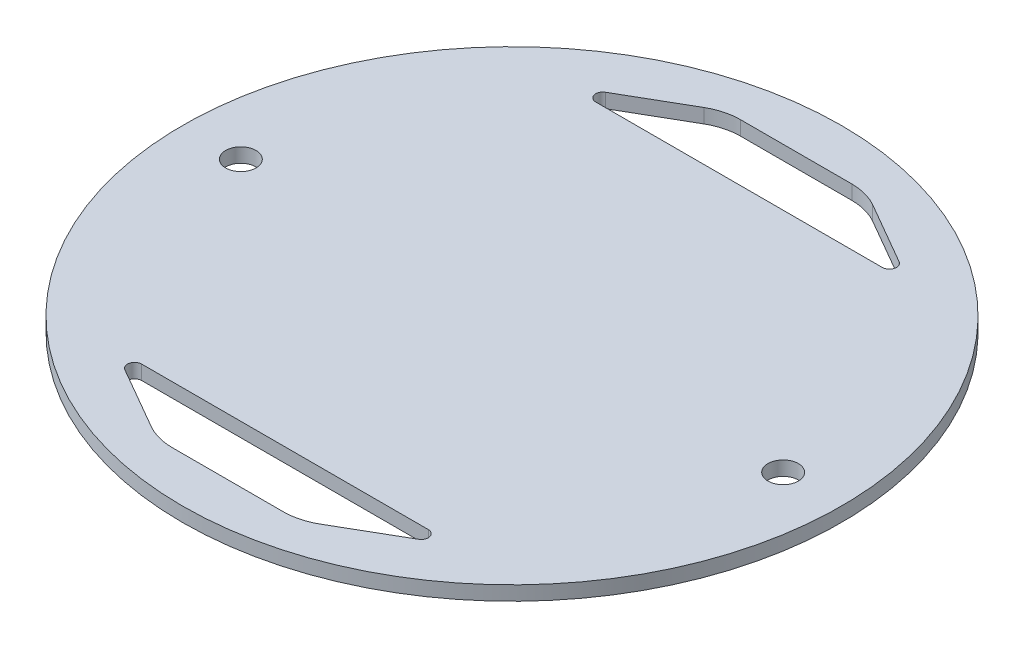
ISO-10303-21;
HEADER;
FILE_DESCRIPTION(('STEP AP214'),'2;1');
FILE_NAME('part.step','',(''),(''),'','','');
FILE_SCHEMA(('AUTOMOTIVE_DESIGN { 1 0 10303 214 1 1 1 1 }'));
ENDSEC;
DATA;
#1=APPLICATION_CONTEXT('core data for automotive mechanical design processes');
#2=APPLICATION_PROTOCOL_DEFINITION('international standard','automotive_design',2000,#1);
#3=PRODUCT_CONTEXT('',#1,'mechanical');
#4=PRODUCT('Part','Part','',(#3));
#5=PRODUCT_RELATED_PRODUCT_CATEGORY('part','',(#4));
#6=PRODUCT_DEFINITION_FORMATION('','',#4);
#7=PRODUCT_DEFINITION_CONTEXT('part definition',#1,'design');
#8=PRODUCT_DEFINITION('design','',#6,#7);
#9=PRODUCT_DEFINITION_SHAPE('','',#8);
#10=(LENGTH_UNIT() NAMED_UNIT(*) SI_UNIT(.MILLI.,.METRE.));
#11=(NAMED_UNIT(*) PLANE_ANGLE_UNIT() SI_UNIT($,.RADIAN.));
#12=(NAMED_UNIT(*) SI_UNIT($,.STERADIAN.) SOLID_ANGLE_UNIT());
#13=UNCERTAINTY_MEASURE_WITH_UNIT(LENGTH_MEASURE(1.E-05),#10,'distance_accuracy_value','');
#14=(GEOMETRIC_REPRESENTATION_CONTEXT(3) GLOBAL_UNCERTAINTY_ASSIGNED_CONTEXT((#13)) GLOBAL_UNIT_ASSIGNED_CONTEXT((#10,
#11,#12)) REPRESENTATION_CONTEXT('',''));
#15=CARTESIAN_POINT('',(0.,0.,0.));
#16=DIRECTION('',(0.,0.,1.));
#17=DIRECTION('',(1.,0.,0.));
#18=AXIS2_PLACEMENT_3D('',#15,#16,#17);
#19=CARTESIAN_POINT('',(0.,3.175,0.));
#20=DIRECTION('',(0.,1.,0.));
#21=DIRECTION('',(0.,0.,1.));
#22=AXIS2_PLACEMENT_3D('',#19,#20,#21);
#23=PLANE('',#22);
#24=DIRECTION('',(-0.866025403784442,0.,0.499999999999995));
#25=VECTOR('',#24,1.);
#26=CARTESIAN_POINT('',(-31.3171414455567,3.175,-54.242880131526));
#27=LINE('',#26,#25);
#28=CARTESIAN_POINT('',(-18.7499999999997,3.175,-61.4985226280624));
#29=VERTEX_POINT('',#28);
#30=CARTESIAN_POINT('',(-32.6691193429844,3.175,-53.4623153285078));
#31=VERTEX_POINT('',#30);
#32=EDGE_CURVE('E282',#29,#31,#27,.T.);
#33=ORIENTED_EDGE('',*,*,#32,.F.);
#34=CARTESIAN_POINT('',(-12.3999999999998,3.175,-50.5));
#35=DIRECTION('',(0.,1.,0.));
#36=DIRECTION('',(0.,0.,1.));
#37=AXIS2_PLACEMENT_3D('',#34,#35,#36);
#38=CIRCLE('',#37,12.7);
#39=CARTESIAN_POINT('',(-12.3999999999998,3.175,-63.2));
#40=VERTEX_POINT('',#39);
#41=EDGE_CURVE('E182',#29,#40,#38,.F.);
#42=ORIENTED_EDGE('',*,*,#41,.T.);
#43=DIRECTION('',(1.,0.,0.));
#44=VECTOR('',#43,1.);
#45=CARTESIAN_POINT('',(0.,3.175,-63.2));
#46=LINE('',#45,#44);
#47=CARTESIAN_POINT('',(12.3999999999998,3.175,-63.2));
#48=VERTEX_POINT('',#47);
#49=EDGE_CURVE('E160',#40,#48,#46,.T.);
#50=ORIENTED_EDGE('',*,*,#49,.T.);
#51=CARTESIAN_POINT('',(12.3999999999998,3.175,-50.5));
#52=DIRECTION('',(0.,1.,0.));
#53=DIRECTION('',(0.,0.,1.));
#54=AXIS2_PLACEMENT_3D('',#51,#52,#53);
#55=CIRCLE('',#54,12.7);
#56=CARTESIAN_POINT('',(18.7499999999997,3.175,-61.4985226280624));
#57=VERTEX_POINT('',#56);
#58=EDGE_CURVE('E306',#48,#57,#55,.F.);
#59=ORIENTED_EDGE('',*,*,#58,.T.);
#60=DIRECTION('',(0.866025403784442,0.,0.499999999999995));
#61=VECTOR('',#60,1.);
#62=CARTESIAN_POINT('',(31.3171414455567,3.175,-54.242880131526));
#63=LINE('',#62,#61);
#64=CARTESIAN_POINT('',(32.6691193429844,3.175,-53.4623153285078));
#65=VERTEX_POINT('',#64);
#66=EDGE_CURVE('E278',#57,#65,#63,.T.);
#67=ORIENTED_EDGE('',*,*,#66,.T.);
#68=CARTESIAN_POINT('',(31.8753693429844,3.175,-52.0875));
#69=DIRECTION('',(0.,1.,0.));
#70=DIRECTION('',(0.,0.,1.));
#71=AXIS2_PLACEMENT_3D('',#68,#69,#70);
#72=CIRCLE('',#71,1.5875);
#73=CARTESIAN_POINT('',(31.8753693429844,3.175,-50.5));
#74=VERTEX_POINT('',#73);
#75=EDGE_CURVE('E196',#65,#74,#72,.F.);
#76=ORIENTED_EDGE('',*,*,#75,.T.);
#77=DIRECTION('',(1.,0.,0.));
#78=VECTOR('',#77,1.);
#79=CARTESIAN_POINT('',(0.,3.175,-50.5));
#80=LINE('',#79,#78);
#81=CARTESIAN_POINT('',(-31.8753693429844,3.175,-50.5));
#82=VERTEX_POINT('',#81);
#83=EDGE_CURVE('E174',#82,#74,#80,.T.);
#84=ORIENTED_EDGE('',*,*,#83,.F.);
#85=CARTESIAN_POINT('',(-31.8753693429844,3.175,-52.0875));
#86=DIRECTION('',(0.,1.,0.));
#87=DIRECTION('',(0.,0.,1.));
#88=AXIS2_PLACEMENT_3D('',#85,#86,#87);
#89=CIRCLE('',#88,1.5875);
#90=EDGE_CURVE('E200',#82,#31,#89,.F.);
#91=ORIENTED_EDGE('',*,*,#90,.T.);
#92=EDGE_LOOP('',(#33,#42,#50,#59,#67,#76,#84,#91));
#93=FACE_BOUND('',#92,.T.);
#94=CARTESIAN_POINT('',(-60.325,3.175,0.));
#95=DIRECTION('',(0.,1.,0.));
#96=DIRECTION('',(0.,0.,1.));
#97=AXIS2_PLACEMENT_3D('',#94,#95,#96);
#98=CIRCLE('',#97,3.37819999999999);
#99=CARTESIAN_POINT('',(-60.325,3.175,3.37819999999999));
#100=VERTEX_POINT('',#99);
#101=EDGE_CURVE('E285',#100,#100,#98,.T.);
#102=ORIENTED_EDGE('',*,*,#101,.F.);
#103=EDGE_LOOP('',(#102));
#104=FACE_BOUND('',#103,.T.);
#105=CARTESIAN_POINT('',(60.325,3.175,0.));
#106=DIRECTION('',(0.,1.,0.));
#107=DIRECTION('',(0.,0.,1.));
#108=AXIS2_PLACEMENT_3D('',#105,#106,#107);
#109=CIRCLE('',#108,3.37819999999999);
#110=CARTESIAN_POINT('',(60.325,3.175,3.37819999999999));
#111=VERTEX_POINT('',#110);
#112=EDGE_CURVE('E291',#111,#111,#109,.T.);
#113=ORIENTED_EDGE('',*,*,#112,.F.);
#114=EDGE_LOOP('',(#113));
#115=FACE_BOUND('',#114,.T.);
#116=CARTESIAN_POINT('',(0.,3.175,0.));
#117=DIRECTION('',(0.,1.,0.));
#118=DIRECTION('',(0.,0.,1.));
#119=AXIS2_PLACEMENT_3D('',#116,#117,#118);
#120=CIRCLE('',#119,73.3171);
#121=CARTESIAN_POINT('',(0.,3.175,73.3171));
#122=VERTEX_POINT('',#121);
#123=EDGE_CURVE('E164',#122,#122,#120,.T.);
#124=ORIENTED_EDGE('',*,*,#123,.T.);
#125=EDGE_LOOP('',(#124));
#126=FACE_BOUND('',#125,.T.);
#127=DIRECTION('',(1.,0.,0.));
#128=VECTOR('',#127,1.);
#129=CARTESIAN_POINT('',(0.,3.175,63.2));
#130=LINE('',#129,#128);
#131=CARTESIAN_POINT('',(-12.3999999999998,3.175,63.2));
#132=VERTEX_POINT('',#131);
#133=CARTESIAN_POINT('',(12.3999999999998,3.175,63.2));
#134=VERTEX_POINT('',#133);
#135=EDGE_CURVE('E263',#132,#134,#130,.T.);
#136=ORIENTED_EDGE('',*,*,#135,.F.);
#137=CARTESIAN_POINT('',(-12.3999999999998,3.175,50.5));
#138=DIRECTION('',(0.,1.,0.));
#139=DIRECTION('',(0.,0.,1.));
#140=AXIS2_PLACEMENT_3D('',#137,#138,#139);
#141=CIRCLE('',#140,12.7);
#142=CARTESIAN_POINT('',(-18.7499999999997,3.175,61.4985226280624));
#143=VERTEX_POINT('',#142);
#144=EDGE_CURVE('E218',#132,#143,#141,.F.);
#145=ORIENTED_EDGE('',*,*,#144,.T.);
#146=DIRECTION('',(-0.866025403784442,0.,-0.499999999999995));
#147=VECTOR('',#146,1.);
#148=CARTESIAN_POINT('',(-31.3171414455567,3.175,54.242880131526));
#149=LINE('',#148,#147);
#150=CARTESIAN_POINT('',(-32.6691193429844,3.175,53.4623153285078));
#151=VERTEX_POINT('',#150);
#152=EDGE_CURVE('E241',#143,#151,#149,.T.);
#153=ORIENTED_EDGE('',*,*,#152,.T.);
#154=CARTESIAN_POINT('',(-31.8753693429844,3.175,52.0875));
#155=DIRECTION('',(0.,1.,0.));
#156=DIRECTION('',(0.,0.,1.));
#157=AXIS2_PLACEMENT_3D('',#154,#155,#156);
#158=CIRCLE('',#157,1.5875);
#159=CARTESIAN_POINT('',(-31.8753693429844,3.175,50.5));
#160=VERTEX_POINT('',#159);
#161=EDGE_CURVE('E47',#151,#160,#158,.F.);
#162=ORIENTED_EDGE('',*,*,#161,.T.);
#163=DIRECTION('',(1.,0.,0.));
#164=VECTOR('',#163,1.);
#165=CARTESIAN_POINT('',(0.,3.175,50.5));
#166=LINE('',#165,#164);
#167=CARTESIAN_POINT('',(31.8753693429844,3.175,50.5));
#168=VERTEX_POINT('',#167);
#169=EDGE_CURVE('E239',#160,#168,#166,.T.);
#170=ORIENTED_EDGE('',*,*,#169,.T.);
#171=CARTESIAN_POINT('',(31.8753693429844,3.175,52.0875));
#172=DIRECTION('',(0.,1.,0.));
#173=DIRECTION('',(0.,0.,1.));
#174=AXIS2_PLACEMENT_3D('',#171,#172,#173);
#175=CIRCLE('',#174,1.5875);
#176=CARTESIAN_POINT('',(32.6691193429844,3.175,53.4623153285078));
#177=VERTEX_POINT('',#176);
#178=EDGE_CURVE('E231',#168,#177,#175,.F.);
#179=ORIENTED_EDGE('',*,*,#178,.T.);
#180=DIRECTION('',(0.866025403784442,0.,-0.499999999999995));
#181=VECTOR('',#180,1.);
#182=CARTESIAN_POINT('',(31.3171414455567,3.175,54.242880131526));
#183=LINE('',#182,#181);
#184=CARTESIAN_POINT('',(18.7499999999997,3.175,61.4985226280624));
#185=VERTEX_POINT('',#184);
#186=EDGE_CURVE('E246',#185,#177,#183,.T.);
#187=ORIENTED_EDGE('',*,*,#186,.F.);
#188=CARTESIAN_POINT('',(12.3999999999998,3.175,50.5));
#189=DIRECTION('',(0.,1.,0.));
#190=DIRECTION('',(0.,0.,1.));
#191=AXIS2_PLACEMENT_3D('',#188,#189,#190);
#192=CIRCLE('',#191,12.7);
#193=EDGE_CURVE('E214',#185,#134,#192,.F.);
#194=ORIENTED_EDGE('',*,*,#193,.T.);
#195=EDGE_LOOP('',(#136,#145,#153,#162,#170,#179,#187,#194));
#196=FACE_BOUND('',#195,.T.);
#197=ADVANCED_FACE('F39',(#93,#104,#115,#126,#196),#23,.T.);
#198=CARTESIAN_POINT('',(0.,0.,0.));
#199=DIRECTION('',(0.,1.,0.));
#200=DIRECTION('',(0.,0.,1.));
#201=AXIS2_PLACEMENT_3D('',#198,#199,#200);
#202=PLANE('',#201);
#203=CARTESIAN_POINT('',(0.,0.,0.));
#204=DIRECTION('',(0.,1.,0.));
#205=DIRECTION('',(0.,0.,1.));
#206=AXIS2_PLACEMENT_3D('',#203,#204,#205);
#207=CIRCLE('',#206,73.3171);
#208=CARTESIAN_POINT('',(0.,0.,73.3171));
#209=VERTEX_POINT('',#208);
#210=EDGE_CURVE('E297',#209,#209,#207,.T.);
#211=ORIENTED_EDGE('',*,*,#210,.F.);
#212=EDGE_LOOP('',(#211));
#213=FACE_BOUND('',#212,.T.);
#214=CARTESIAN_POINT('',(60.325,0.,0.));
#215=DIRECTION('',(0.,1.,0.));
#216=DIRECTION('',(0.,0.,1.));
#217=AXIS2_PLACEMENT_3D('',#214,#215,#216);
#218=CIRCLE('',#217,3.3782);
#219=CARTESIAN_POINT('',(60.325,0.,3.3782));
#220=VERTEX_POINT('',#219);
#221=EDGE_CURVE('E294',#220,#220,#218,.T.);
#222=ORIENTED_EDGE('',*,*,#221,.T.);
#223=EDGE_LOOP('',(#222));
#224=FACE_BOUND('',#223,.T.);
#225=CARTESIAN_POINT('',(-60.325,0.,0.));
#226=DIRECTION('',(0.,1.,0.));
#227=DIRECTION('',(0.,0.,1.));
#228=AXIS2_PLACEMENT_3D('',#225,#226,#227);
#229=CIRCLE('',#228,3.3782);
#230=CARTESIAN_POINT('',(-60.325,0.,3.3782));
#231=VERTEX_POINT('',#230);
#232=EDGE_CURVE('E288',#231,#231,#229,.T.);
#233=ORIENTED_EDGE('',*,*,#232,.T.);
#234=EDGE_LOOP('',(#233));
#235=FACE_BOUND('',#234,.T.);
#236=DIRECTION('',(1.,0.,0.));
#237=VECTOR('',#236,1.);
#238=CARTESIAN_POINT('',(0.,0.,-63.2));
#239=LINE('',#238,#237);
#240=CARTESIAN_POINT('',(-12.3999999999998,0.,-63.2));
#241=VERTEX_POINT('',#240);
#242=CARTESIAN_POINT('',(12.3999999999998,0.,-63.2));
#243=VERTEX_POINT('',#242);
#244=EDGE_CURVE('E157',#241,#243,#239,.T.);
#245=ORIENTED_EDGE('',*,*,#244,.F.);
#246=CARTESIAN_POINT('',(-12.3999999999998,0.,-50.5));
#247=DIRECTION('',(0.,1.,0.));
#248=DIRECTION('',(0.,0.,1.));
#249=AXIS2_PLACEMENT_3D('',#246,#247,#248);
#250=CIRCLE('',#249,12.7);
#251=CARTESIAN_POINT('',(-18.7499999999997,0.,-61.4985226280624));
#252=VERTEX_POINT('',#251);
#253=EDGE_CURVE('E169',#241,#252,#250,.T.);
#254=ORIENTED_EDGE('',*,*,#253,.T.);
#255=DIRECTION('',(-0.866025403784442,0.,0.499999999999995));
#256=VECTOR('',#255,1.);
#257=CARTESIAN_POINT('',(-31.3171414455567,0.,-54.242880131526));
#258=LINE('',#257,#256);
#259=CARTESIAN_POINT('',(-32.6691193429844,0.,-53.4623153285078));
#260=VERTEX_POINT('',#259);
#261=EDGE_CURVE('E269',#252,#260,#258,.T.);
#262=ORIENTED_EDGE('',*,*,#261,.T.);
#263=CARTESIAN_POINT('',(-31.8753693429844,0.,-52.0875));
#264=DIRECTION('',(0.,1.,0.));
#265=DIRECTION('',(0.,0.,1.));
#266=AXIS2_PLACEMENT_3D('',#263,#264,#265);
#267=CIRCLE('',#266,1.5875);
#268=CARTESIAN_POINT('',(-31.8753693429844,0.,-50.5));
#269=VERTEX_POINT('',#268);
#270=EDGE_CURVE('E202',#260,#269,#267,.T.);
#271=ORIENTED_EDGE('',*,*,#270,.T.);
#272=DIRECTION('',(1.,0.,0.));
#273=VECTOR('',#272,1.);
#274=CARTESIAN_POINT('',(0.,0.,-50.5));
#275=LINE('',#274,#273);
#276=CARTESIAN_POINT('',(31.8753693429844,0.,-50.5));
#277=VERTEX_POINT('',#276);
#278=EDGE_CURVE('E271',#269,#277,#275,.T.);
#279=ORIENTED_EDGE('',*,*,#278,.T.);
#280=CARTESIAN_POINT('',(31.8753693429844,0.,-52.0875));
#281=DIRECTION('',(0.,1.,0.));
#282=DIRECTION('',(0.,0.,1.));
#283=AXIS2_PLACEMENT_3D('',#280,#281,#282);
#284=CIRCLE('',#283,1.5875);
#285=CARTESIAN_POINT('',(32.6691193429844,0.,-53.4623153285078));
#286=VERTEX_POINT('',#285);
#287=EDGE_CURVE('E198',#277,#286,#284,.T.);
#288=ORIENTED_EDGE('',*,*,#287,.T.);
#289=DIRECTION('',(0.866025403784442,0.,0.499999999999995));
#290=VECTOR('',#289,1.);
#291=CARTESIAN_POINT('',(31.3171414455567,0.,-54.242880131526));
#292=LINE('',#291,#290);
#293=CARTESIAN_POINT('',(18.7499999999997,0.,-61.4985226280624));
#294=VERTEX_POINT('',#293);
#295=EDGE_CURVE('E175',#294,#286,#292,.T.);
#296=ORIENTED_EDGE('',*,*,#295,.F.);
#297=CARTESIAN_POINT('',(12.3999999999998,0.,-50.5));
#298=DIRECTION('',(0.,1.,0.));
#299=DIRECTION('',(0.,0.,1.));
#300=AXIS2_PLACEMENT_3D('',#297,#298,#299);
#301=CIRCLE('',#300,12.7);
#302=EDGE_CURVE('E173',#294,#243,#301,.T.);
#303=ORIENTED_EDGE('',*,*,#302,.T.);
#304=EDGE_LOOP('',(#245,#254,#262,#271,#279,#288,#296,#303));
#305=FACE_BOUND('',#304,.T.);
#306=DIRECTION('',(-0.866025403784442,0.,-0.499999999999995));
#307=VECTOR('',#306,1.);
#308=CARTESIAN_POINT('',(-31.3171414455567,0.,54.242880131526));
#309=LINE('',#308,#307);
#310=CARTESIAN_POINT('',(-18.7499999999997,0.,61.4985226280624));
#311=VERTEX_POINT('',#310);
#312=CARTESIAN_POINT('',(-32.6691193429844,0.,53.4623153285078));
#313=VERTEX_POINT('',#312);
#314=EDGE_CURVE('E251',#311,#313,#309,.T.);
#315=ORIENTED_EDGE('',*,*,#314,.F.);
#316=CARTESIAN_POINT('',(-12.3999999999998,0.,50.5));
#317=DIRECTION('',(0.,1.,0.));
#318=DIRECTION('',(0.,0.,1.));
#319=AXIS2_PLACEMENT_3D('',#316,#317,#318);
#320=CIRCLE('',#319,12.7);
#321=CARTESIAN_POINT('',(-12.3999999999998,0.,63.2));
#322=VERTEX_POINT('',#321);
#323=EDGE_CURVE('E220',#311,#322,#320,.T.);
#324=ORIENTED_EDGE('',*,*,#323,.T.);
#325=DIRECTION('',(1.,0.,0.));
#326=VECTOR('',#325,1.);
#327=CARTESIAN_POINT('',(0.,0.,63.2));
#328=LINE('',#327,#326);
#329=CARTESIAN_POINT('',(12.3999999999998,0.,63.2));
#330=VERTEX_POINT('',#329);
#331=EDGE_CURVE('E253',#322,#330,#328,.T.);
#332=ORIENTED_EDGE('',*,*,#331,.T.);
#333=CARTESIAN_POINT('',(12.3999999999998,0.,50.5));
#334=DIRECTION('',(0.,1.,0.));
#335=DIRECTION('',(0.,0.,1.));
#336=AXIS2_PLACEMENT_3D('',#333,#334,#335);
#337=CIRCLE('',#336,12.7);
#338=CARTESIAN_POINT('',(18.7499999999997,0.,61.4985226280624));
#339=VERTEX_POINT('',#338);
#340=EDGE_CURVE('E216',#330,#339,#337,.T.);
#341=ORIENTED_EDGE('',*,*,#340,.T.);
#342=DIRECTION('',(0.866025403784442,0.,-0.499999999999995));
#343=VECTOR('',#342,1.);
#344=CARTESIAN_POINT('',(31.3171414455567,0.,54.242880131526));
#345=LINE('',#344,#343);
#346=CARTESIAN_POINT('',(32.6691193429844,0.,53.4623153285078));
#347=VERTEX_POINT('',#346);
#348=EDGE_CURVE('E256',#339,#347,#345,.T.);
#349=ORIENTED_EDGE('',*,*,#348,.T.);
#350=CARTESIAN_POINT('',(31.8753693429844,0.,52.0875));
#351=DIRECTION('',(0.,1.,0.));
#352=DIRECTION('',(0.,0.,1.));
#353=AXIS2_PLACEMENT_3D('',#350,#351,#352);
#354=CIRCLE('',#353,1.5875);
#355=CARTESIAN_POINT('',(31.8753693429844,0.,50.5));
#356=VERTEX_POINT('',#355);
#357=EDGE_CURVE('E233',#347,#356,#354,.T.);
#358=ORIENTED_EDGE('',*,*,#357,.T.);
#359=DIRECTION('',(1.,0.,0.));
#360=VECTOR('',#359,1.);
#361=CARTESIAN_POINT('',(0.,0.,50.5));
#362=LINE('',#361,#360);
#363=CARTESIAN_POINT('',(-31.8753693429844,0.,50.5));
#364=VERTEX_POINT('',#363);
#365=EDGE_CURVE('E261',#364,#356,#362,.T.);
#366=ORIENTED_EDGE('',*,*,#365,.F.);
#367=CARTESIAN_POINT('',(-31.8753693429844,0.,52.0875));
#368=DIRECTION('',(0.,1.,0.));
#369=DIRECTION('',(0.,0.,1.));
#370=AXIS2_PLACEMENT_3D('',#367,#368,#369);
#371=CIRCLE('',#370,1.5875);
#372=EDGE_CURVE('E11',#364,#313,#371,.T.);
#373=ORIENTED_EDGE('',*,*,#372,.T.);
#374=EDGE_LOOP('',(#315,#324,#332,#341,#349,#358,#366,#373));
#375=FACE_BOUND('',#374,.T.);
#376=ADVANCED_FACE('F167',(#213,#224,#235,#305,#375),#202,.F.);
#377=CARTESIAN_POINT('',(0.,3.175,0.));
#378=DIRECTION('',(0.,-1.,0.));
#379=DIRECTION('',(0.,0.,-1.));
#380=AXIS2_PLACEMENT_3D('',#377,#378,#379);
#381=CYLINDRICAL_SURFACE('',#380,73.3171);
#382=ORIENTED_EDGE('',*,*,#123,.F.);
#383=EDGE_LOOP('',(#382));
#384=FACE_BOUND('',#383,.T.);
#385=ORIENTED_EDGE('',*,*,#210,.T.);
#386=EDGE_LOOP('',(#385));
#387=FACE_BOUND('',#386,.T.);
#388=ADVANCED_FACE('F336',(#384,#387),#381,.T.);
#389=CARTESIAN_POINT('',(60.325,3.175,0.));
#390=DIRECTION('',(0.,1.,0.));
#391=DIRECTION('',(0.,0.,1.));
#392=AXIS2_PLACEMENT_3D('',#389,#390,#391);
#393=CYLINDRICAL_SURFACE('',#392,3.3782);
#394=ORIENTED_EDGE('',*,*,#221,.F.);
#395=EDGE_LOOP('',(#394));
#396=FACE_BOUND('',#395,.T.);
#397=ORIENTED_EDGE('',*,*,#112,.T.);
#398=EDGE_LOOP('',(#397));
#399=FACE_BOUND('',#398,.T.);
#400=ADVANCED_FACE('F340',(#396,#399),#393,.F.);
#401=CARTESIAN_POINT('',(-60.325,3.175,0.));
#402=DIRECTION('',(0.,1.,0.));
#403=DIRECTION('',(0.,0.,1.));
#404=AXIS2_PLACEMENT_3D('',#401,#402,#403);
#405=CYLINDRICAL_SURFACE('',#404,3.37819999999999);
#406=ORIENTED_EDGE('',*,*,#232,.F.);
#407=EDGE_LOOP('',(#406));
#408=FACE_BOUND('',#407,.T.);
#409=ORIENTED_EDGE('',*,*,#101,.T.);
#410=EDGE_LOOP('',(#409));
#411=FACE_BOUND('',#410,.T.);
#412=ADVANCED_FACE('F347',(#408,#411),#405,.F.);
#413=CARTESIAN_POINT('',(-31.3171414455567,0.,-54.242880131526));
#414=DIRECTION('',(-0.499999999999995,0.,-0.866025403784441));
#415=DIRECTION('',(-0.866025403784442,0.,0.499999999999995));
#416=AXIS2_PLACEMENT_3D('',#413,#414,#415);
#417=PLANE('',#416);
#418=ORIENTED_EDGE('',*,*,#32,.T.);
#419=DIRECTION('',(0.,1.,0.));
#420=VECTOR('',#419,1.);
#421=CARTESIAN_POINT('',(-32.6691193429844,0.,-53.4623153285078));
#422=LINE('',#421,#420);
#423=EDGE_CURVE('E194',#31,#260,#422,.F.);
#424=ORIENTED_EDGE('',*,*,#423,.T.);
#425=ORIENTED_EDGE('',*,*,#261,.F.);
#426=DIRECTION('',(0.,1.,0.));
#427=VECTOR('',#426,1.);
#428=CARTESIAN_POINT('',(-18.7499999999997,0.,-61.4985226280624));
#429=LINE('',#428,#427);
#430=EDGE_CURVE('E180',#252,#29,#429,.T.);
#431=ORIENTED_EDGE('',*,*,#430,.T.);
#432=EDGE_LOOP('',(#418,#424,#425,#431));
#433=FACE_BOUND('',#432,.T.);
#434=ADVANCED_FACE('F359',(#433),#417,.F.);
#435=CARTESIAN_POINT('',(0.,0.,-63.2));
#436=DIRECTION('',(0.,0.,1.));
#437=DIRECTION('',(1.,0.,0.));
#438=AXIS2_PLACEMENT_3D('',#435,#436,#437);
#439=PLANE('',#438);
#440=ORIENTED_EDGE('',*,*,#244,.T.);
#441=DIRECTION('',(0.,1.,0.));
#442=VECTOR('',#441,1.);
#443=CARTESIAN_POINT('',(12.3999999999998,3.175,-63.2));
#444=LINE('',#443,#442);
#445=EDGE_CURVE('E163',#243,#48,#444,.T.);
#446=ORIENTED_EDGE('',*,*,#445,.T.);
#447=ORIENTED_EDGE('',*,*,#49,.F.);
#448=DIRECTION('',(0.,1.,0.));
#449=VECTOR('',#448,1.);
#450=CARTESIAN_POINT('',(-12.3999999999998,0.,-63.2));
#451=LINE('',#450,#449);
#452=EDGE_CURVE('E153',#40,#241,#451,.F.);
#453=ORIENTED_EDGE('',*,*,#452,.T.);
#454=EDGE_LOOP('',(#440,#446,#447,#453));
#455=FACE_BOUND('',#454,.T.);
#456=ADVANCED_FACE('F155',(#455),#439,.T.);
#457=CARTESIAN_POINT('',(31.3171414455567,0.,-54.242880131526));
#458=DIRECTION('',(-0.499999999999995,0.,0.866025403784441));
#459=DIRECTION('',(0.866025403784442,0.,0.499999999999995));
#460=AXIS2_PLACEMENT_3D('',#457,#458,#459);
#461=PLANE('',#460);
#462=ORIENTED_EDGE('',*,*,#295,.T.);
#463=DIRECTION('',(0.,1.,0.));
#464=VECTOR('',#463,1.);
#465=CARTESIAN_POINT('',(32.6691193429844,0.,-53.4623153285078));
#466=LINE('',#465,#464);
#467=EDGE_CURVE('E181',#286,#65,#466,.T.);
#468=ORIENTED_EDGE('',*,*,#467,.T.);
#469=ORIENTED_EDGE('',*,*,#66,.F.);
#470=DIRECTION('',(0.,1.,0.));
#471=VECTOR('',#470,1.);
#472=CARTESIAN_POINT('',(18.7499999999997,0.,-61.4985226280624));
#473=LINE('',#472,#471);
#474=EDGE_CURVE('E303',#57,#294,#473,.F.);
#475=ORIENTED_EDGE('',*,*,#474,.T.);
#476=EDGE_LOOP('',(#462,#468,#469,#475));
#477=FACE_BOUND('',#476,.T.);
#478=ADVANCED_FACE('F314',(#477),#461,.T.);
#479=CARTESIAN_POINT('',(0.,0.,-50.5));
#480=DIRECTION('',(0.,0.,1.));
#481=DIRECTION('',(1.,0.,0.));
#482=AXIS2_PLACEMENT_3D('',#479,#480,#481);
#483=PLANE('',#482);
#484=ORIENTED_EDGE('',*,*,#83,.T.);
#485=DIRECTION('',(0.,1.,0.));
#486=VECTOR('',#485,1.);
#487=CARTESIAN_POINT('',(31.8753693429844,0.,-50.5));
#488=LINE('',#487,#486);
#489=EDGE_CURVE('E192',#74,#277,#488,.F.);
#490=ORIENTED_EDGE('',*,*,#489,.T.);
#491=ORIENTED_EDGE('',*,*,#278,.F.);
#492=DIRECTION('',(0.,1.,0.));
#493=VECTOR('',#492,1.);
#494=CARTESIAN_POINT('',(-31.8753693429844,3.175,-50.5));
#495=LINE('',#494,#493);
#496=EDGE_CURVE('E185',#269,#82,#495,.T.);
#497=ORIENTED_EDGE('',*,*,#496,.T.);
#498=EDGE_LOOP('',(#484,#490,#491,#497));
#499=FACE_BOUND('',#498,.T.);
#500=ADVANCED_FACE('F318',(#499),#483,.F.);
#501=CARTESIAN_POINT('',(12.3999999999998,0.,-50.5));
#502=DIRECTION('',(0.,-1.,0.));
#503=DIRECTION('',(0.,0.,-1.));
#504=AXIS2_PLACEMENT_3D('',#501,#502,#503);
#505=CYLINDRICAL_SURFACE('',#504,12.7);
#506=ORIENTED_EDGE('',*,*,#302,.F.);
#507=ORIENTED_EDGE('',*,*,#474,.F.);
#508=ORIENTED_EDGE('',*,*,#58,.F.);
#509=ORIENTED_EDGE('',*,*,#445,.F.);
#510=EDGE_LOOP('',(#506,#507,#508,#509));
#511=FACE_BOUND('',#510,.T.);
#512=ADVANCED_FACE('F316',(#511),#505,.F.);
#513=CARTESIAN_POINT('',(-12.3999999999998,0.,-50.5));
#514=DIRECTION('',(0.,1.,0.));
#515=DIRECTION('',(0.,0.,1.));
#516=AXIS2_PLACEMENT_3D('',#513,#514,#515);
#517=CYLINDRICAL_SURFACE('',#516,12.7);
#518=ORIENTED_EDGE('',*,*,#253,.F.);
#519=ORIENTED_EDGE('',*,*,#452,.F.);
#520=ORIENTED_EDGE('',*,*,#41,.F.);
#521=ORIENTED_EDGE('',*,*,#430,.F.);
#522=EDGE_LOOP('',(#518,#519,#520,#521));
#523=FACE_BOUND('',#522,.T.);
#524=ADVANCED_FACE('F178',(#523),#517,.F.);
#525=CARTESIAN_POINT('',(31.8753693429844,0.,-52.0875));
#526=DIRECTION('',(0.,1.,0.));
#527=DIRECTION('',(0.,0.,1.));
#528=AXIS2_PLACEMENT_3D('',#525,#526,#527);
#529=CYLINDRICAL_SURFACE('',#528,1.5875);
#530=ORIENTED_EDGE('',*,*,#287,.F.);
#531=ORIENTED_EDGE('',*,*,#489,.F.);
#532=ORIENTED_EDGE('',*,*,#75,.F.);
#533=ORIENTED_EDGE('',*,*,#467,.F.);
#534=EDGE_LOOP('',(#530,#531,#532,#533));
#535=FACE_BOUND('',#534,.T.);
#536=ADVANCED_FACE('F324',(#535),#529,.F.);
#537=CARTESIAN_POINT('',(-31.8753693429844,0.,-52.0875));
#538=DIRECTION('',(0.,-1.,0.));
#539=DIRECTION('',(0.,0.,-1.));
#540=AXIS2_PLACEMENT_3D('',#537,#538,#539);
#541=CYLINDRICAL_SURFACE('',#540,1.5875);
#542=ORIENTED_EDGE('',*,*,#270,.F.);
#543=ORIENTED_EDGE('',*,*,#423,.F.);
#544=ORIENTED_EDGE('',*,*,#90,.F.);
#545=ORIENTED_EDGE('',*,*,#496,.F.);
#546=EDGE_LOOP('',(#542,#543,#544,#545));
#547=FACE_BOUND('',#546,.T.);
#548=ADVANCED_FACE('F376',(#547),#541,.F.);
#549=CARTESIAN_POINT('',(-31.3171414455567,0.,54.242880131526));
#550=DIRECTION('',(0.499999999999995,0.,-0.866025403784441));
#551=DIRECTION('',(-0.866025403784442,0.,-0.499999999999995));
#552=AXIS2_PLACEMENT_3D('',#549,#550,#551);
#553=PLANE('',#552);
#554=ORIENTED_EDGE('',*,*,#314,.T.);
#555=DIRECTION('',(0.,1.,0.));
#556=VECTOR('',#555,1.);
#557=CARTESIAN_POINT('',(-32.6691193429844,3.175,53.4623153285078));
#558=LINE('',#557,#556);
#559=EDGE_CURVE('E229',#313,#151,#558,.T.);
#560=ORIENTED_EDGE('',*,*,#559,.T.);
#561=ORIENTED_EDGE('',*,*,#152,.F.);
#562=DIRECTION('',(0.,1.,0.));
#563=VECTOR('',#562,1.);
#564=CARTESIAN_POINT('',(-18.7499999999997,0.,61.4985226280624));
#565=LINE('',#564,#563);
#566=EDGE_CURVE('E212',#143,#311,#565,.F.);
#567=ORIENTED_EDGE('',*,*,#566,.T.);
#568=EDGE_LOOP('',(#554,#560,#561,#567));
#569=FACE_BOUND('',#568,.T.);
#570=ADVANCED_FACE('F249',(#569),#553,.T.);
#571=CARTESIAN_POINT('',(0.,0.,50.5));
#572=DIRECTION('',(0.,0.,1.));
#573=DIRECTION('',(1.,0.,0.));
#574=AXIS2_PLACEMENT_3D('',#571,#572,#573);
#575=PLANE('',#574);
#576=ORIENTED_EDGE('',*,*,#365,.T.);
#577=DIRECTION('',(0.,1.,0.));
#578=VECTOR('',#577,1.);
#579=CARTESIAN_POINT('',(31.8753693429844,0.,50.5));
#580=LINE('',#579,#578);
#581=EDGE_CURVE('E224',#356,#168,#580,.T.);
#582=ORIENTED_EDGE('',*,*,#581,.T.);
#583=ORIENTED_EDGE('',*,*,#169,.F.);
#584=DIRECTION('',(0.,1.,0.));
#585=VECTOR('',#584,1.);
#586=CARTESIAN_POINT('',(-31.8753693429844,0.,50.5));
#587=LINE('',#586,#585);
#588=EDGE_CURVE('E222',#160,#364,#587,.F.);
#589=ORIENTED_EDGE('',*,*,#588,.T.);
#590=EDGE_LOOP('',(#576,#582,#583,#589));
#591=FACE_BOUND('',#590,.T.);
#592=ADVANCED_FACE('F244',(#591),#575,.T.);
#593=CARTESIAN_POINT('',(31.3171414455567,0.,54.242880131526));
#594=DIRECTION('',(0.499999999999995,0.,0.866025403784441));
#595=DIRECTION('',(0.866025403784442,0.,-0.499999999999995));
#596=AXIS2_PLACEMENT_3D('',#593,#594,#595);
#597=PLANE('',#596);
#598=ORIENTED_EDGE('',*,*,#186,.T.);
#599=DIRECTION('',(0.,1.,0.));
#600=VECTOR('',#599,1.);
#601=CARTESIAN_POINT('',(32.6691193429844,0.,53.4623153285078));
#602=LINE('',#601,#600);
#603=EDGE_CURVE('E227',#177,#347,#602,.F.);
#604=ORIENTED_EDGE('',*,*,#603,.T.);
#605=ORIENTED_EDGE('',*,*,#348,.F.);
#606=DIRECTION('',(0.,1.,0.));
#607=VECTOR('',#606,1.);
#608=CARTESIAN_POINT('',(18.7499999999997,3.175,61.4985226280624));
#609=LINE('',#608,#607);
#610=EDGE_CURVE('E204',#339,#185,#609,.T.);
#611=ORIENTED_EDGE('',*,*,#610,.T.);
#612=EDGE_LOOP('',(#598,#604,#605,#611));
#613=FACE_BOUND('',#612,.T.);
#614=ADVANCED_FACE('F381',(#613),#597,.F.);
#615=CARTESIAN_POINT('',(0.,0.,63.2));
#616=DIRECTION('',(0.,0.,1.));
#617=DIRECTION('',(1.,0.,0.));
#618=AXIS2_PLACEMENT_3D('',#615,#616,#617);
#619=PLANE('',#618);
#620=ORIENTED_EDGE('',*,*,#135,.T.);
#621=DIRECTION('',(0.,1.,0.));
#622=VECTOR('',#621,1.);
#623=CARTESIAN_POINT('',(12.3999999999998,0.,63.2));
#624=LINE('',#623,#622);
#625=EDGE_CURVE('E210',#134,#330,#624,.F.);
#626=ORIENTED_EDGE('',*,*,#625,.T.);
#627=ORIENTED_EDGE('',*,*,#331,.F.);
#628=DIRECTION('',(0.,1.,0.));
#629=VECTOR('',#628,1.);
#630=CARTESIAN_POINT('',(-12.3999999999998,0.,63.2));
#631=LINE('',#630,#629);
#632=EDGE_CURVE('E207',#322,#132,#631,.T.);
#633=ORIENTED_EDGE('',*,*,#632,.T.);
#634=EDGE_LOOP('',(#620,#626,#627,#633));
#635=FACE_BOUND('',#634,.T.);
#636=ADVANCED_FACE('F377',(#635),#619,.F.);
#637=CARTESIAN_POINT('',(12.3999999999998,0.,50.5));
#638=DIRECTION('',(0.,-1.,0.));
#639=DIRECTION('',(0.,0.,-1.));
#640=AXIS2_PLACEMENT_3D('',#637,#638,#639);
#641=CYLINDRICAL_SURFACE('',#640,12.7);
#642=ORIENTED_EDGE('',*,*,#340,.F.);
#643=ORIENTED_EDGE('',*,*,#625,.F.);
#644=ORIENTED_EDGE('',*,*,#193,.F.);
#645=ORIENTED_EDGE('',*,*,#610,.F.);
#646=EDGE_LOOP('',(#642,#643,#644,#645));
#647=FACE_BOUND('',#646,.T.);
#648=ADVANCED_FACE('F380',(#647),#641,.F.);
#649=CARTESIAN_POINT('',(-12.3999999999998,0.,50.5));
#650=DIRECTION('',(0.,1.,0.));
#651=DIRECTION('',(0.,0.,1.));
#652=AXIS2_PLACEMENT_3D('',#649,#650,#651);
#653=CYLINDRICAL_SURFACE('',#652,12.7);
#654=ORIENTED_EDGE('',*,*,#323,.F.);
#655=ORIENTED_EDGE('',*,*,#566,.F.);
#656=ORIENTED_EDGE('',*,*,#144,.F.);
#657=ORIENTED_EDGE('',*,*,#632,.F.);
#658=EDGE_LOOP('',(#654,#655,#656,#657));
#659=FACE_BOUND('',#658,.T.);
#660=ADVANCED_FACE('F408',(#659),#653,.F.);
#661=CARTESIAN_POINT('',(31.8753693429844,0.,52.0875));
#662=DIRECTION('',(0.,1.,0.));
#663=DIRECTION('',(0.,0.,1.));
#664=AXIS2_PLACEMENT_3D('',#661,#662,#663);
#665=CYLINDRICAL_SURFACE('',#664,1.5875);
#666=ORIENTED_EDGE('',*,*,#357,.F.);
#667=ORIENTED_EDGE('',*,*,#603,.F.);
#668=ORIENTED_EDGE('',*,*,#178,.F.);
#669=ORIENTED_EDGE('',*,*,#581,.F.);
#670=EDGE_LOOP('',(#666,#667,#668,#669));
#671=FACE_BOUND('',#670,.T.);
#672=ADVANCED_FACE('F417',(#671),#665,.F.);
#673=CARTESIAN_POINT('',(-31.8753693429844,0.,52.0875));
#674=DIRECTION('',(0.,-1.,0.));
#675=DIRECTION('',(0.,0.,-1.));
#676=AXIS2_PLACEMENT_3D('',#673,#674,#675);
#677=CYLINDRICAL_SURFACE('',#676,1.5875);
#678=ORIENTED_EDGE('',*,*,#372,.F.);
#679=ORIENTED_EDGE('',*,*,#588,.F.);
#680=ORIENTED_EDGE('',*,*,#161,.F.);
#681=ORIENTED_EDGE('',*,*,#559,.F.);
#682=EDGE_LOOP('',(#678,#679,#680,#681));
#683=FACE_BOUND('',#682,.T.);
#684=ADVANCED_FACE('F41',(#683),#677,.F.);
#685=CLOSED_SHELL('',(#197,#376,#388,#400,#412,#434,#456,#478,#500,#512,#524,#536,#548,#570,
#592,#614,#636,#648,#660,#672,#684));
#686=MANIFOLD_SOLID_BREP('B2',#685);
#687=ADVANCED_BREP_SHAPE_REPRESENTATION('',(#18,#686),#14);
#688=SHAPE_DEFINITION_REPRESENTATION(#9,#687);
ENDSEC;
END-ISO-10303-21;
